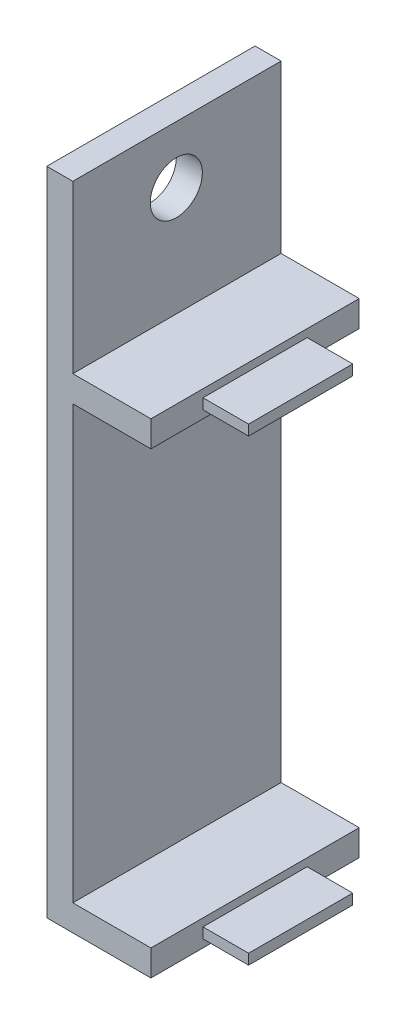
ISO-10303-21;
HEADER;
FILE_DESCRIPTION(('STEP AP214'),'2;1');
FILE_NAME('part.step','',(''),(''),'','','');
FILE_SCHEMA(('AUTOMOTIVE_DESIGN { 1 0 10303 214 1 1 1 1 }'));
ENDSEC;
DATA;
#1=APPLICATION_CONTEXT('core data for automotive mechanical design processes');
#2=APPLICATION_PROTOCOL_DEFINITION('international standard','automotive_design',2000,#1);
#3=PRODUCT_CONTEXT('',#1,'mechanical');
#4=PRODUCT('Part','Part','',(#3));
#5=PRODUCT_RELATED_PRODUCT_CATEGORY('part','',(#4));
#6=PRODUCT_DEFINITION_FORMATION('','',#4);
#7=PRODUCT_DEFINITION_CONTEXT('part definition',#1,'design');
#8=PRODUCT_DEFINITION('design','',#6,#7);
#9=PRODUCT_DEFINITION_SHAPE('','',#8);
#10=(LENGTH_UNIT() NAMED_UNIT(*) SI_UNIT(.MILLI.,.METRE.));
#11=(NAMED_UNIT(*) PLANE_ANGLE_UNIT() SI_UNIT($,.RADIAN.));
#12=(NAMED_UNIT(*) SI_UNIT($,.STERADIAN.) SOLID_ANGLE_UNIT());
#13=UNCERTAINTY_MEASURE_WITH_UNIT(LENGTH_MEASURE(1.E-05),#10,'distance_accuracy_value','');
#14=(GEOMETRIC_REPRESENTATION_CONTEXT(3) GLOBAL_UNCERTAINTY_ASSIGNED_CONTEXT((#13)) GLOBAL_UNIT_ASSIGNED_CONTEXT((#10,
#11,#12)) REPRESENTATION_CONTEXT('',''));
#15=CARTESIAN_POINT('',(0.,0.,0.));
#16=DIRECTION('',(0.,0.,1.));
#17=DIRECTION('',(1.,0.,0.));
#18=AXIS2_PLACEMENT_3D('',#15,#16,#17);
#19=CARTESIAN_POINT('',(-18.6732333333333,-18.84045,10.16));
#20=DIRECTION('',(-1.,0.,0.));
#21=DIRECTION('',(0.,0.,1.));
#22=AXIS2_PLACEMENT_3D('',#19,#20,#21);
#23=PLANE('',#22);
#24=DIRECTION('',(0.,1.,0.));
#25=VECTOR('',#24,1.);
#26=CARTESIAN_POINT('',(-18.6732333333333,-18.84045,0.));
#27=LINE('',#26,#25);
#28=CARTESIAN_POINT('',(-18.6732333333333,-20.11045,0.));
#29=VERTEX_POINT('',#28);
#30=CARTESIAN_POINT('',(-18.6732333333333,-18.84045,0.));
#31=VERTEX_POINT('',#30);
#32=EDGE_CURVE('E307',#29,#31,#27,.T.);
#33=ORIENTED_EDGE('',*,*,#32,.T.);
#34=DIRECTION('',(0.,0.,-1.));
#35=VECTOR('',#34,1.);
#36=CARTESIAN_POINT('',(-18.6732333333333,-18.84045,10.16));
#37=LINE('',#36,#35);
#38=CARTESIAN_POINT('',(-18.6732333333333,-18.84045,10.16));
#39=VERTEX_POINT('',#38);
#40=EDGE_CURVE('E323',#39,#31,#37,.T.);
#41=ORIENTED_EDGE('',*,*,#40,.F.);
#42=DIRECTION('',(0.,1.,0.));
#43=VECTOR('',#42,1.);
#44=CARTESIAN_POINT('',(-18.6732333333333,-18.84045,10.16));
#45=LINE('',#44,#43);
#46=CARTESIAN_POINT('',(-18.6732333333333,-20.11045,10.16));
#47=VERTEX_POINT('',#46);
#48=EDGE_CURVE('E286',#47,#39,#45,.T.);
#49=ORIENTED_EDGE('',*,*,#48,.F.);
#50=DIRECTION('',(0.,0.,-1.));
#51=VECTOR('',#50,1.);
#52=CARTESIAN_POINT('',(-18.6732333333333,-20.11045,10.16));
#53=LINE('',#52,#51);
#54=EDGE_CURVE('E327',#47,#29,#53,.T.);
#55=ORIENTED_EDGE('',*,*,#54,.T.);
#56=EDGE_LOOP('',(#33,#41,#49,#55));
#57=FACE_BOUND('',#56,.T.);
#58=DIRECTION('',(0.,0.,1.));
#59=VECTOR('',#58,1.);
#60=CARTESIAN_POINT('',(-18.6732333333333,-19.22145,2.54));
#61=LINE('',#60,#59);
#62=CARTESIAN_POINT('',(-18.6732333333333,-19.22145,2.54));
#63=VERTEX_POINT('',#62);
#64=CARTESIAN_POINT('',(-18.6732333333333,-19.22145,7.62));
#65=VERTEX_POINT('',#64);
#66=EDGE_CURVE('E188',#63,#65,#61,.T.);
#67=ORIENTED_EDGE('',*,*,#66,.F.);
#68=DIRECTION('',(0.,1.,0.));
#69=VECTOR('',#68,1.);
#70=CARTESIAN_POINT('',(-18.6732333333333,-19.72945,2.54));
#71=LINE('',#70,#69);
#72=CARTESIAN_POINT('',(-18.6732333333333,-19.72945,2.54));
#73=VERTEX_POINT('',#72);
#74=EDGE_CURVE('E185',#73,#63,#71,.T.);
#75=ORIENTED_EDGE('',*,*,#74,.F.);
#76=DIRECTION('',(0.,0.,-1.));
#77=VECTOR('',#76,1.);
#78=CARTESIAN_POINT('',(-18.6732333333333,-19.72945,7.62));
#79=LINE('',#78,#77);
#80=CARTESIAN_POINT('',(-18.6732333333333,-19.72945,7.62));
#81=VERTEX_POINT('',#80);
#82=EDGE_CURVE('E61',#81,#73,#79,.T.);
#83=ORIENTED_EDGE('',*,*,#82,.F.);
#84=DIRECTION('',(0.,-1.,0.));
#85=VECTOR('',#84,1.);
#86=CARTESIAN_POINT('',(-18.6732333333333,-19.22145,7.62));
#87=LINE('',#86,#85);
#88=EDGE_CURVE('E56',#65,#81,#87,.T.);
#89=ORIENTED_EDGE('',*,*,#88,.F.);
#90=EDGE_LOOP('',(#67,#75,#83,#89));
#91=FACE_BOUND('',#90,.T.);
#92=ADVANCED_FACE('F39',(#57,#91),#23,.F.);
#93=CARTESIAN_POINT('',(-18.6732333333333,0.,0.));
#94=DIRECTION('',(1.,0.,0.));
#95=DIRECTION('',(0.,0.,-1.));
#96=AXIS2_PLACEMENT_3D('',#93,#94,#95);
#97=PLANE('',#96);
#98=DIRECTION('',(0.,-1.,0.));
#99=VECTOR('',#98,1.);
#100=CARTESIAN_POINT('',(-18.6732333333333,3.51155,10.16));
#101=LINE('',#100,#99);
#102=CARTESIAN_POINT('',(-18.6732333333333,3.51155,10.16));
#103=VERTEX_POINT('',#102);
#104=CARTESIAN_POINT('',(-18.6732333333333,2.24155,10.16));
#105=VERTEX_POINT('',#104);
#106=EDGE_CURVE('E238',#103,#105,#101,.T.);
#107=ORIENTED_EDGE('',*,*,#106,.T.);
#108=DIRECTION('',(0.,0.,-1.));
#109=VECTOR('',#108,1.);
#110=CARTESIAN_POINT('',(-18.6732333333333,2.24155,10.16));
#111=LINE('',#110,#109);
#112=CARTESIAN_POINT('',(-18.6732333333333,2.24155,0.));
#113=VERTEX_POINT('',#112);
#114=EDGE_CURVE('E242',#105,#113,#111,.T.);
#115=ORIENTED_EDGE('',*,*,#114,.T.);
#116=DIRECTION('',(0.,1.,0.));
#117=VECTOR('',#116,1.);
#118=CARTESIAN_POINT('',(-18.6732333333333,2.24155,0.));
#119=LINE('',#118,#117);
#120=CARTESIAN_POINT('',(-18.6732333333333,3.51155,0.));
#121=VERTEX_POINT('',#120);
#122=EDGE_CURVE('E246',#113,#121,#119,.T.);
#123=ORIENTED_EDGE('',*,*,#122,.T.);
#124=DIRECTION('',(0.,0.,1.));
#125=VECTOR('',#124,1.);
#126=CARTESIAN_POINT('',(-18.6732333333333,3.51155,0.));
#127=LINE('',#126,#125);
#128=EDGE_CURVE('E249',#121,#103,#127,.T.);
#129=ORIENTED_EDGE('',*,*,#128,.T.);
#130=EDGE_LOOP('',(#107,#115,#123,#129));
#131=FACE_BOUND('',#130,.T.);
#132=DIRECTION('',(0.,-1.,0.));
#133=VECTOR('',#132,1.);
#134=CARTESIAN_POINT('',(-18.6732333333333,3.13055,7.62));
#135=LINE('',#134,#133);
#136=CARTESIAN_POINT('',(-18.6732333333333,3.13055,7.62));
#137=VERTEX_POINT('',#136);
#138=CARTESIAN_POINT('',(-18.6732333333333,2.62255,7.62));
#139=VERTEX_POINT('',#138);
#140=EDGE_CURVE('E195',#137,#139,#135,.T.);
#141=ORIENTED_EDGE('',*,*,#140,.F.);
#142=DIRECTION('',(0.,0.,1.));
#143=VECTOR('',#142,1.);
#144=CARTESIAN_POINT('',(-18.6732333333333,3.13055,2.54));
#145=LINE('',#144,#143);
#146=CARTESIAN_POINT('',(-18.6732333333333,3.13055,2.54));
#147=VERTEX_POINT('',#146);
#148=EDGE_CURVE('E190',#147,#137,#145,.T.);
#149=ORIENTED_EDGE('',*,*,#148,.F.);
#150=DIRECTION('',(0.,1.,0.));
#151=VECTOR('',#150,1.);
#152=CARTESIAN_POINT('',(-18.6732333333333,2.62255,2.54));
#153=LINE('',#152,#151);
#154=CARTESIAN_POINT('',(-18.6732333333333,2.62255,2.54));
#155=VERTEX_POINT('',#154);
#156=EDGE_CURVE('E206',#155,#147,#153,.T.);
#157=ORIENTED_EDGE('',*,*,#156,.F.);
#158=DIRECTION('',(0.,0.,-1.));
#159=VECTOR('',#158,1.);
#160=CARTESIAN_POINT('',(-18.6732333333333,2.62255,7.62));
#161=LINE('',#160,#159);
#162=EDGE_CURVE('E218',#139,#155,#161,.T.);
#163=ORIENTED_EDGE('',*,*,#162,.F.);
#164=EDGE_LOOP('',(#141,#149,#157,#163));
#165=FACE_BOUND('',#164,.T.);
#166=ADVANCED_FACE('F374',(#131,#165),#97,.T.);
#167=CARTESIAN_POINT('',(-22.4832333333333,11.63955,10.16));
#168=DIRECTION('',(-1.,0.,0.));
#169=DIRECTION('',(0.,-1.,0.));
#170=AXIS2_PLACEMENT_3D('',#167,#168,#169);
#171=PLANE('',#170);
#172=DIRECTION('',(0.,0.,-1.));
#173=VECTOR('',#172,1.);
#174=CARTESIAN_POINT('',(-22.4832333333333,2.24155,10.16));
#175=LINE('',#174,#173);
#176=CARTESIAN_POINT('',(-22.4832333333333,2.24155000000001,10.16));
#177=VERTEX_POINT('',#176);
#178=CARTESIAN_POINT('',(-22.4832333333333,2.24155000000001,0.));
#179=VERTEX_POINT('',#178);
#180=EDGE_CURVE('E237',#177,#179,#175,.T.);
#181=ORIENTED_EDGE('',*,*,#180,.F.);
#182=DIRECTION('',(0.,1.,0.));
#183=VECTOR('',#182,1.);
#184=CARTESIAN_POINT('',(-22.4832333333333,11.63955,10.16));
#185=LINE('',#184,#183);
#186=CARTESIAN_POINT('',(-22.4832333333333,-18.84045,10.16));
#187=VERTEX_POINT('',#186);
#188=EDGE_CURVE('E293',#187,#177,#185,.T.);
#189=ORIENTED_EDGE('',*,*,#188,.F.);
#190=DIRECTION('',(0.,0.,-1.));
#191=VECTOR('',#190,1.);
#192=CARTESIAN_POINT('',(-22.4832333333333,-18.84045,10.16));
#193=LINE('',#192,#191);
#194=CARTESIAN_POINT('',(-22.4832333333333,-18.84045,0.));
#195=VERTEX_POINT('',#194);
#196=EDGE_CURVE('E319',#187,#195,#193,.T.);
#197=ORIENTED_EDGE('',*,*,#196,.T.);
#198=DIRECTION('',(0.,1.,0.));
#199=VECTOR('',#198,1.);
#200=CARTESIAN_POINT('',(-22.4832333333333,11.63955,0.));
#201=LINE('',#200,#199);
#202=EDGE_CURVE('E280',#195,#179,#201,.T.);
#203=ORIENTED_EDGE('',*,*,#202,.T.);
#204=EDGE_LOOP('',(#181,#189,#197,#203));
#205=FACE_BOUND('',#204,.T.);
#206=ADVANCED_FACE('F380',(#205),#171,.F.);
#207=CARTESIAN_POINT('',(-22.4832333333333,8.84555,5.11168207856704));
#208=DIRECTION('',(1.,0.,0.));
#209=DIRECTION('',(0.,1.,0.));
#210=AXIS2_PLACEMENT_3D('',#207,#208,#209);
#211=CIRCLE('',#210,1.27);
#212=CARTESIAN_POINT('',(-22.4832333333333,10.11555,5.11168207856704));
#213=VERTEX_POINT('',#212);
#214=EDGE_CURVE('E406',#213,#213,#211,.T.);
#215=ORIENTED_EDGE('',*,*,#214,.F.);
#216=EDGE_LOOP('',(#215));
#217=FACE_BOUND('',#216,.T.);
#218=DIRECTION('',(0.,0.,1.));
#219=VECTOR('',#218,1.);
#220=CARTESIAN_POINT('',(-22.4832333333333,3.51155,0.));
#221=LINE('',#220,#219);
#222=CARTESIAN_POINT('',(-22.4832333333333,3.51155,0.));
#223=VERTEX_POINT('',#222);
#224=CARTESIAN_POINT('',(-22.4832333333333,3.51155000000001,10.16));
#225=VERTEX_POINT('',#224);
#226=EDGE_CURVE('E243',#223,#225,#221,.T.);
#227=ORIENTED_EDGE('',*,*,#226,.F.);
#228=CARTESIAN_POINT('',(-22.4832333333333,11.63955,0.));
#229=VERTEX_POINT('',#228);
#230=EDGE_CURVE('E313',#223,#229,#201,.T.);
#231=ORIENTED_EDGE('',*,*,#230,.T.);
#232=DIRECTION('',(0.,0.,-1.));
#233=VECTOR('',#232,1.);
#234=CARTESIAN_POINT('',(-22.4832333333333,11.63955,10.16));
#235=LINE('',#234,#233);
#236=CARTESIAN_POINT('',(-22.4832333333333,11.63955,10.16));
#237=VERTEX_POINT('',#236);
#238=EDGE_CURVE('E297',#237,#229,#235,.T.);
#239=ORIENTED_EDGE('',*,*,#238,.F.);
#240=EDGE_CURVE('E292',#225,#237,#185,.T.);
#241=ORIENTED_EDGE('',*,*,#240,.F.);
#242=EDGE_LOOP('',(#227,#231,#239,#241));
#243=FACE_BOUND('',#242,.T.);
#244=ADVANCED_FACE('F368',(#217,#243),#171,.F.);
#245=CARTESIAN_POINT('',(-23.7532333333333,11.63955,10.16));
#246=DIRECTION('',(0.,-1.,0.));
#247=DIRECTION('',(0.,0.,-1.));
#248=AXIS2_PLACEMENT_3D('',#245,#246,#247);
#249=PLANE('',#248);
#250=DIRECTION('',(-1.,0.,0.));
#251=VECTOR('',#250,1.);
#252=CARTESIAN_POINT('',(-23.7532333333333,11.63955,0.));
#253=LINE('',#252,#251);
#254=CARTESIAN_POINT('',(-23.7532333333333,11.63955,0.));
#255=VERTEX_POINT('',#254);
#256=EDGE_CURVE('E274',#229,#255,#253,.T.);
#257=ORIENTED_EDGE('',*,*,#256,.T.);
#258=DIRECTION('',(0.,0.,-1.));
#259=VECTOR('',#258,1.);
#260=CARTESIAN_POINT('',(-23.7532333333333,11.63955,10.16));
#261=LINE('',#260,#259);
#262=CARTESIAN_POINT('',(-23.7532333333333,11.63955,10.16));
#263=VERTEX_POINT('',#262);
#264=EDGE_CURVE('E11',#263,#255,#261,.T.);
#265=ORIENTED_EDGE('',*,*,#264,.F.);
#266=DIRECTION('',(-1.,0.,0.));
#267=VECTOR('',#266,1.);
#268=CARTESIAN_POINT('',(-23.7532333333333,11.63955,10.16));
#269=LINE('',#268,#267);
#270=EDGE_CURVE('E275',#237,#263,#269,.T.);
#271=ORIENTED_EDGE('',*,*,#270,.F.);
#272=ORIENTED_EDGE('',*,*,#238,.T.);
#273=EDGE_LOOP('',(#257,#265,#271,#272));
#274=FACE_BOUND('',#273,.T.);
#275=ADVANCED_FACE('F41',(#274),#249,.F.);
#276=CARTESIAN_POINT('',(-23.7532333333333,-20.11045,10.16));
#277=DIRECTION('',(1.,0.,0.));
#278=DIRECTION('',(0.,0.,-1.));
#279=AXIS2_PLACEMENT_3D('',#276,#277,#278);
#280=PLANE('',#279);
#281=CARTESIAN_POINT('',(-23.7532333333333,8.84555,5.11168207856704));
#282=DIRECTION('',(1.,0.,0.));
#283=DIRECTION('',(0.,0.,-1.));
#284=AXIS2_PLACEMENT_3D('',#281,#282,#283);
#285=CIRCLE('',#284,1.27);
#286=CARTESIAN_POINT('',(-23.7532333333333,8.84555,3.84168207856704));
#287=VERTEX_POINT('',#286);
#288=EDGE_CURVE('E43',#287,#287,#285,.T.);
#289=ORIENTED_EDGE('',*,*,#288,.T.);
#290=EDGE_LOOP('',(#289));
#291=FACE_BOUND('',#290,.T.);
#292=DIRECTION('',(0.,-1.,0.));
#293=VECTOR('',#292,1.);
#294=CARTESIAN_POINT('',(-23.7532333333333,-20.11045,0.));
#295=LINE('',#294,#293);
#296=CARTESIAN_POINT('',(-23.7532333333333,-20.11045,0.));
#297=VERTEX_POINT('',#296);
#298=EDGE_CURVE('E301',#255,#297,#295,.T.);
#299=ORIENTED_EDGE('',*,*,#298,.T.);
#300=DIRECTION('',(0.,0.,-1.));
#301=VECTOR('',#300,1.);
#302=CARTESIAN_POINT('',(-23.7532333333333,-20.11045,10.16));
#303=LINE('',#302,#301);
#304=CARTESIAN_POINT('',(-23.7532333333333,-20.11045,10.16));
#305=VERTEX_POINT('',#304);
#306=EDGE_CURVE('E49',#305,#297,#303,.T.);
#307=ORIENTED_EDGE('',*,*,#306,.F.);
#308=DIRECTION('',(0.,-1.,0.));
#309=VECTOR('',#308,1.);
#310=CARTESIAN_POINT('',(-23.7532333333333,-20.11045,10.16));
#311=LINE('',#310,#309);
#312=EDGE_CURVE('E279',#263,#305,#311,.T.);
#313=ORIENTED_EDGE('',*,*,#312,.F.);
#314=ORIENTED_EDGE('',*,*,#264,.T.);
#315=EDGE_LOOP('',(#299,#307,#313,#314));
#316=FACE_BOUND('',#315,.T.);
#317=ADVANCED_FACE('F359',(#291,#316),#280,.F.);
#318=CARTESIAN_POINT('',(-18.6732333333333,-20.11045,10.16));
#319=DIRECTION('',(0.,1.,0.));
#320=DIRECTION('',(0.,0.,1.));
#321=AXIS2_PLACEMENT_3D('',#318,#319,#320);
#322=PLANE('',#321);
#323=DIRECTION('',(1.,0.,0.));
#324=VECTOR('',#323,1.);
#325=CARTESIAN_POINT('',(-18.6732333333333,-20.11045,0.));
#326=LINE('',#325,#324);
#327=EDGE_CURVE('E304',#297,#29,#326,.T.);
#328=ORIENTED_EDGE('',*,*,#327,.T.);
#329=ORIENTED_EDGE('',*,*,#54,.F.);
#330=DIRECTION('',(1.,0.,0.));
#331=VECTOR('',#330,1.);
#332=CARTESIAN_POINT('',(-18.6732333333333,-20.11045,10.16));
#333=LINE('',#332,#331);
#334=EDGE_CURVE('E283',#305,#47,#333,.T.);
#335=ORIENTED_EDGE('',*,*,#334,.F.);
#336=ORIENTED_EDGE('',*,*,#306,.T.);
#337=EDGE_LOOP('',(#328,#329,#335,#336));
#338=FACE_BOUND('',#337,.T.);
#339=ADVANCED_FACE('F337',(#338),#322,.F.);
#340=CARTESIAN_POINT('',(-22.4832333333333,-18.84045,10.16));
#341=DIRECTION('',(0.,-1.,0.));
#342=DIRECTION('',(0.,0.,-1.));
#343=AXIS2_PLACEMENT_3D('',#340,#341,#342);
#344=PLANE('',#343);
#345=DIRECTION('',(-1.,0.,0.));
#346=VECTOR('',#345,1.);
#347=CARTESIAN_POINT('',(-22.4832333333333,-18.84045,0.));
#348=LINE('',#347,#346);
#349=EDGE_CURVE('E310',#31,#195,#348,.T.);
#350=ORIENTED_EDGE('',*,*,#349,.T.);
#351=ORIENTED_EDGE('',*,*,#196,.F.);
#352=DIRECTION('',(-1.,0.,0.));
#353=VECTOR('',#352,1.);
#354=CARTESIAN_POINT('',(-22.4832333333333,-18.84045,10.16));
#355=LINE('',#354,#353);
#356=EDGE_CURVE('E289',#39,#187,#355,.T.);
#357=ORIENTED_EDGE('',*,*,#356,.F.);
#358=ORIENTED_EDGE('',*,*,#40,.T.);
#359=EDGE_LOOP('',(#350,#351,#357,#358));
#360=FACE_BOUND('',#359,.T.);
#361=ADVANCED_FACE('F351',(#360),#344,.F.);
#362=CARTESIAN_POINT('',(0.,0.,10.16));
#363=DIRECTION('',(0.,0.,-1.));
#364=DIRECTION('',(-1.,0.,0.));
#365=AXIS2_PLACEMENT_3D('',#362,#363,#364);
#366=PLANE('',#365);
#367=ORIENTED_EDGE('',*,*,#270,.T.);
#368=ORIENTED_EDGE('',*,*,#312,.T.);
#369=ORIENTED_EDGE('',*,*,#334,.T.);
#370=ORIENTED_EDGE('',*,*,#48,.T.);
#371=ORIENTED_EDGE('',*,*,#356,.T.);
#372=ORIENTED_EDGE('',*,*,#188,.T.);
#373=DIRECTION('',(-1.,0.,0.));
#374=VECTOR('',#373,1.);
#375=CARTESIAN_POINT('',(-18.6732333333333,2.24155,10.16));
#376=LINE('',#375,#374);
#377=EDGE_CURVE('E270',#105,#177,#376,.T.);
#378=ORIENTED_EDGE('',*,*,#377,.F.);
#379=ORIENTED_EDGE('',*,*,#106,.F.);
#380=DIRECTION('',(-1.,0.,0.));
#381=VECTOR('',#380,1.);
#382=CARTESIAN_POINT('',(-18.6732333333333,3.51155,10.16));
#383=LINE('',#382,#381);
#384=EDGE_CURVE('E252',#103,#225,#383,.T.);
#385=ORIENTED_EDGE('',*,*,#384,.T.);
#386=ORIENTED_EDGE('',*,*,#240,.T.);
#387=EDGE_LOOP('',(#367,#368,#369,#370,#371,#372,#378,#379,#385,#386));
#388=FACE_BOUND('',#387,.T.);
#389=ADVANCED_FACE('F355',(#388),#366,.F.);
#390=CARTESIAN_POINT('',(0.,0.,0.));
#391=DIRECTION('',(0.,0.,-1.));
#392=DIRECTION('',(-1.,0.,0.));
#393=AXIS2_PLACEMENT_3D('',#390,#391,#392);
#394=PLANE('',#393);
#395=ORIENTED_EDGE('',*,*,#256,.F.);
#396=ORIENTED_EDGE('',*,*,#230,.F.);
#397=DIRECTION('',(-1.,0.,0.));
#398=VECTOR('',#397,1.);
#399=CARTESIAN_POINT('',(-18.6732333333333,3.51155,0.));
#400=LINE('',#399,#398);
#401=EDGE_CURVE('E262',#121,#223,#400,.T.);
#402=ORIENTED_EDGE('',*,*,#401,.F.);
#403=ORIENTED_EDGE('',*,*,#122,.F.);
#404=DIRECTION('',(-1.,0.,0.));
#405=VECTOR('',#404,1.);
#406=CARTESIAN_POINT('',(-18.6732333333333,2.24155,0.));
#407=LINE('',#406,#405);
#408=EDGE_CURVE('E266',#113,#179,#407,.T.);
#409=ORIENTED_EDGE('',*,*,#408,.T.);
#410=ORIENTED_EDGE('',*,*,#202,.F.);
#411=ORIENTED_EDGE('',*,*,#349,.F.);
#412=ORIENTED_EDGE('',*,*,#32,.F.);
#413=ORIENTED_EDGE('',*,*,#327,.F.);
#414=ORIENTED_EDGE('',*,*,#298,.F.);
#415=EDGE_LOOP('',(#395,#396,#402,#403,#409,#410,#411,#412,#413,#414));
#416=FACE_BOUND('',#415,.T.);
#417=ADVANCED_FACE('F343',(#416),#394,.T.);
#418=CARTESIAN_POINT('',(-18.6732333333333,2.24155,10.16));
#419=DIRECTION('',(0.,1.,0.));
#420=DIRECTION('',(-1.,0.,0.));
#421=AXIS2_PLACEMENT_3D('',#418,#419,#420);
#422=PLANE('',#421);
#423=ORIENTED_EDGE('',*,*,#180,.T.);
#424=ORIENTED_EDGE('',*,*,#408,.F.);
#425=ORIENTED_EDGE('',*,*,#114,.F.);
#426=ORIENTED_EDGE('',*,*,#377,.T.);
#427=EDGE_LOOP('',(#423,#424,#425,#426));
#428=FACE_BOUND('',#427,.T.);
#429=ADVANCED_FACE('F378',(#428),#422,.F.);
#430=CARTESIAN_POINT('',(-18.6732333333333,3.51155,0.));
#431=DIRECTION('',(0.,-1.,0.));
#432=DIRECTION('',(0.,0.,-1.));
#433=AXIS2_PLACEMENT_3D('',#430,#431,#432);
#434=PLANE('',#433);
#435=ORIENTED_EDGE('',*,*,#226,.T.);
#436=ORIENTED_EDGE('',*,*,#384,.F.);
#437=ORIENTED_EDGE('',*,*,#128,.F.);
#438=ORIENTED_EDGE('',*,*,#401,.T.);
#439=EDGE_LOOP('',(#435,#436,#437,#438));
#440=FACE_BOUND('',#439,.T.);
#441=ADVANCED_FACE('F371',(#440),#434,.F.);
#442=CARTESIAN_POINT('',(-16.4507333333333,3.13055,2.54));
#443=DIRECTION('',(0.,-1.,0.));
#444=DIRECTION('',(0.,0.,-1.));
#445=AXIS2_PLACEMENT_3D('',#442,#443,#444);
#446=PLANE('',#445);
#447=ORIENTED_EDGE('',*,*,#148,.T.);
#448=DIRECTION('',(-1.,0.,0.));
#449=VECTOR('',#448,1.);
#450=CARTESIAN_POINT('',(-16.4507333333333,3.13055,7.62));
#451=LINE('',#450,#449);
#452=CARTESIAN_POINT('',(-16.4507333333333,3.13055,7.62));
#453=VERTEX_POINT('',#452);
#454=EDGE_CURVE('E234',#453,#137,#451,.T.);
#455=ORIENTED_EDGE('',*,*,#454,.F.);
#456=DIRECTION('',(0.,0.,1.));
#457=VECTOR('',#456,1.);
#458=CARTESIAN_POINT('',(-16.4507333333333,3.13055,2.54));
#459=LINE('',#458,#457);
#460=CARTESIAN_POINT('',(-16.4507333333333,3.13055,2.54));
#461=VERTEX_POINT('',#460);
#462=EDGE_CURVE('E201',#461,#453,#459,.T.);
#463=ORIENTED_EDGE('',*,*,#462,.F.);
#464=DIRECTION('',(-1.,0.,0.));
#465=VECTOR('',#464,1.);
#466=CARTESIAN_POINT('',(-16.4507333333333,3.13055,2.54));
#467=LINE('',#466,#465);
#468=EDGE_CURVE('E214',#461,#147,#467,.T.);
#469=ORIENTED_EDGE('',*,*,#468,.T.);
#470=EDGE_LOOP('',(#447,#455,#463,#469));
#471=FACE_BOUND('',#470,.T.);
#472=ADVANCED_FACE('F462',(#471),#446,.F.);
#473=CARTESIAN_POINT('',(-16.4507333333333,3.13055,7.62));
#474=DIRECTION('',(0.,0.,-1.));
#475=DIRECTION('',(-1.,0.,0.));
#476=AXIS2_PLACEMENT_3D('',#473,#474,#475);
#477=PLANE('',#476);
#478=ORIENTED_EDGE('',*,*,#140,.T.);
#479=DIRECTION('',(-1.,0.,0.));
#480=VECTOR('',#479,1.);
#481=CARTESIAN_POINT('',(-16.4507333333333,2.62255,7.62));
#482=LINE('',#481,#480);
#483=CARTESIAN_POINT('',(-16.4507333333333,2.62255,7.62));
#484=VERTEX_POINT('',#483);
#485=EDGE_CURVE('E230',#484,#139,#482,.T.);
#486=ORIENTED_EDGE('',*,*,#485,.F.);
#487=DIRECTION('',(0.,-1.,0.));
#488=VECTOR('',#487,1.);
#489=CARTESIAN_POINT('',(-16.4507333333333,3.13055,7.62));
#490=LINE('',#489,#488);
#491=EDGE_CURVE('E205',#453,#484,#490,.T.);
#492=ORIENTED_EDGE('',*,*,#491,.F.);
#493=ORIENTED_EDGE('',*,*,#454,.T.);
#494=EDGE_LOOP('',(#478,#486,#492,#493));
#495=FACE_BOUND('',#494,.T.);
#496=ADVANCED_FACE('F458',(#495),#477,.F.);
#497=CARTESIAN_POINT('',(-16.4507333333333,2.62255,7.62));
#498=DIRECTION('',(0.,1.,0.));
#499=DIRECTION('',(0.,0.,1.));
#500=AXIS2_PLACEMENT_3D('',#497,#498,#499);
#501=PLANE('',#500);
#502=ORIENTED_EDGE('',*,*,#162,.T.);
#503=DIRECTION('',(-1.,0.,0.));
#504=VECTOR('',#503,1.);
#505=CARTESIAN_POINT('',(-16.4507333333333,2.62255,2.54));
#506=LINE('',#505,#504);
#507=CARTESIAN_POINT('',(-16.4507333333333,2.62255,2.54));
#508=VERTEX_POINT('',#507);
#509=EDGE_CURVE('E227',#508,#155,#506,.T.);
#510=ORIENTED_EDGE('',*,*,#509,.F.);
#511=DIRECTION('',(0.,0.,-1.));
#512=VECTOR('',#511,1.);
#513=CARTESIAN_POINT('',(-16.4507333333333,2.62255,7.62));
#514=LINE('',#513,#512);
#515=EDGE_CURVE('E209',#484,#508,#514,.T.);
#516=ORIENTED_EDGE('',*,*,#515,.F.);
#517=ORIENTED_EDGE('',*,*,#485,.T.);
#518=EDGE_LOOP('',(#502,#510,#516,#517));
#519=FACE_BOUND('',#518,.T.);
#520=ADVANCED_FACE('F454',(#519),#501,.F.);
#521=CARTESIAN_POINT('',(-16.4507333333333,2.62255,2.54));
#522=DIRECTION('',(0.,0.,1.));
#523=DIRECTION('',(1.,0.,0.));
#524=AXIS2_PLACEMENT_3D('',#521,#522,#523);
#525=PLANE('',#524);
#526=ORIENTED_EDGE('',*,*,#156,.T.);
#527=ORIENTED_EDGE('',*,*,#468,.F.);
#528=DIRECTION('',(0.,1.,0.));
#529=VECTOR('',#528,1.);
#530=CARTESIAN_POINT('',(-16.4507333333333,2.62255,2.54));
#531=LINE('',#530,#529);
#532=EDGE_CURVE('E212',#508,#461,#531,.T.);
#533=ORIENTED_EDGE('',*,*,#532,.F.);
#534=ORIENTED_EDGE('',*,*,#509,.T.);
#535=EDGE_LOOP('',(#526,#527,#533,#534));
#536=FACE_BOUND('',#535,.T.);
#537=ADVANCED_FACE('F450',(#536),#525,.F.);
#538=CARTESIAN_POINT('',(-16.4507333333333,0.,0.));
#539=DIRECTION('',(1.,0.,0.));
#540=DIRECTION('',(0.,0.,-1.));
#541=AXIS2_PLACEMENT_3D('',#538,#539,#540);
#542=PLANE('',#541);
#543=ORIENTED_EDGE('',*,*,#462,.T.);
#544=ORIENTED_EDGE('',*,*,#491,.T.);
#545=ORIENTED_EDGE('',*,*,#515,.T.);
#546=ORIENTED_EDGE('',*,*,#532,.T.);
#547=EDGE_LOOP('',(#543,#544,#545,#546));
#548=FACE_BOUND('',#547,.T.);
#549=ADVANCED_FACE('F447',(#548),#542,.T.);
#550=CARTESIAN_POINT('',(-16.4507333333333,-19.22145,2.54));
#551=DIRECTION('',(0.,-1.,0.));
#552=DIRECTION('',(0.,0.,-1.));
#553=AXIS2_PLACEMENT_3D('',#550,#551,#552);
#554=PLANE('',#553);
#555=ORIENTED_EDGE('',*,*,#66,.T.);
#556=DIRECTION('',(-1.,0.,0.));
#557=VECTOR('',#556,1.);
#558=CARTESIAN_POINT('',(-16.4507333333333,-19.22145,7.62));
#559=LINE('',#558,#557);
#560=CARTESIAN_POINT('',(-16.4507333333333,-19.22145,7.62));
#561=VERTEX_POINT('',#560);
#562=EDGE_CURVE('E167',#561,#65,#559,.T.);
#563=ORIENTED_EDGE('',*,*,#562,.F.);
#564=DIRECTION('',(0.,0.,1.));
#565=VECTOR('',#564,1.);
#566=CARTESIAN_POINT('',(-16.4507333333333,-19.22145,2.54));
#567=LINE('',#566,#565);
#568=CARTESIAN_POINT('',(-16.4507333333333,-19.22145,2.54));
#569=VERTEX_POINT('',#568);
#570=EDGE_CURVE('E175',#569,#561,#567,.T.);
#571=ORIENTED_EDGE('',*,*,#570,.F.);
#572=DIRECTION('',(-1.,0.,0.));
#573=VECTOR('',#572,1.);
#574=CARTESIAN_POINT('',(-16.4507333333333,-19.22145,2.54));
#575=LINE('',#574,#573);
#576=EDGE_CURVE('E418',#569,#63,#575,.T.);
#577=ORIENTED_EDGE('',*,*,#576,.T.);
#578=EDGE_LOOP('',(#555,#563,#571,#577));
#579=FACE_BOUND('',#578,.T.);
#580=ADVANCED_FACE('F187',(#579),#554,.F.);
#581=CARTESIAN_POINT('',(-16.4507333333333,-19.22145,7.62));
#582=DIRECTION('',(0.,0.,-1.));
#583=DIRECTION('',(-1.,0.,0.));
#584=AXIS2_PLACEMENT_3D('',#581,#582,#583);
#585=PLANE('',#584);
#586=ORIENTED_EDGE('',*,*,#88,.T.);
#587=DIRECTION('',(-1.,0.,0.));
#588=VECTOR('',#587,1.);
#589=CARTESIAN_POINT('',(-16.4507333333333,-19.72945,7.62));
#590=LINE('',#589,#588);
#591=CARTESIAN_POINT('',(-16.4507333333333,-19.72945,7.62));
#592=VERTEX_POINT('',#591);
#593=EDGE_CURVE('E170',#592,#81,#590,.T.);
#594=ORIENTED_EDGE('',*,*,#593,.F.);
#595=DIRECTION('',(0.,-1.,0.));
#596=VECTOR('',#595,1.);
#597=CARTESIAN_POINT('',(-16.4507333333333,-19.22145,7.62));
#598=LINE('',#597,#596);
#599=EDGE_CURVE('E163',#561,#592,#598,.T.);
#600=ORIENTED_EDGE('',*,*,#599,.F.);
#601=ORIENTED_EDGE('',*,*,#562,.T.);
#602=EDGE_LOOP('',(#586,#594,#600,#601));
#603=FACE_BOUND('',#602,.T.);
#604=ADVANCED_FACE('F165',(#603),#585,.F.);
#605=CARTESIAN_POINT('',(-16.4507333333333,-19.72945,7.62));
#606=DIRECTION('',(0.,1.,0.));
#607=DIRECTION('',(0.,0.,1.));
#608=AXIS2_PLACEMENT_3D('',#605,#606,#607);
#609=PLANE('',#608);
#610=ORIENTED_EDGE('',*,*,#82,.T.);
#611=DIRECTION('',(-1.,0.,0.));
#612=VECTOR('',#611,1.);
#613=CARTESIAN_POINT('',(-16.4507333333333,-19.72945,2.54));
#614=LINE('',#613,#612);
#615=CARTESIAN_POINT('',(-16.4507333333333,-19.72945,2.54));
#616=VERTEX_POINT('',#615);
#617=EDGE_CURVE('E197',#616,#73,#614,.T.);
#618=ORIENTED_EDGE('',*,*,#617,.F.);
#619=DIRECTION('',(0.,0.,-1.));
#620=VECTOR('',#619,1.);
#621=CARTESIAN_POINT('',(-16.4507333333333,-19.72945,7.62));
#622=LINE('',#621,#620);
#623=EDGE_CURVE('E174',#592,#616,#622,.T.);
#624=ORIENTED_EDGE('',*,*,#623,.F.);
#625=ORIENTED_EDGE('',*,*,#593,.T.);
#626=EDGE_LOOP('',(#610,#618,#624,#625));
#627=FACE_BOUND('',#626,.T.);
#628=ADVANCED_FACE('F434',(#627),#609,.F.);
#629=CARTESIAN_POINT('',(-16.4507333333333,-19.72945,2.54));
#630=DIRECTION('',(0.,0.,1.));
#631=DIRECTION('',(1.,0.,0.));
#632=AXIS2_PLACEMENT_3D('',#629,#630,#631);
#633=PLANE('',#632);
#634=ORIENTED_EDGE('',*,*,#74,.T.);
#635=ORIENTED_EDGE('',*,*,#576,.F.);
#636=DIRECTION('',(0.,1.,0.));
#637=VECTOR('',#636,1.);
#638=CARTESIAN_POINT('',(-16.4507333333333,-19.72945,2.54));
#639=LINE('',#638,#637);
#640=EDGE_CURVE('E180',#616,#569,#639,.T.);
#641=ORIENTED_EDGE('',*,*,#640,.F.);
#642=ORIENTED_EDGE('',*,*,#617,.T.);
#643=EDGE_LOOP('',(#634,#635,#641,#642));
#644=FACE_BOUND('',#643,.T.);
#645=ADVANCED_FACE('F432',(#644),#633,.F.);
#646=CARTESIAN_POINT('',(-16.4507333333333,0.,0.));
#647=DIRECTION('',(1.,0.,0.));
#648=DIRECTION('',(0.,0.,-1.));
#649=AXIS2_PLACEMENT_3D('',#646,#647,#648);
#650=PLANE('',#649);
#651=ORIENTED_EDGE('',*,*,#570,.T.);
#652=ORIENTED_EDGE('',*,*,#599,.T.);
#653=ORIENTED_EDGE('',*,*,#623,.T.);
#654=ORIENTED_EDGE('',*,*,#640,.T.);
#655=EDGE_LOOP('',(#651,#652,#653,#654));
#656=FACE_BOUND('',#655,.T.);
#657=ADVANCED_FACE('F178',(#656),#650,.T.);
#658=CARTESIAN_POINT('',(-24.7057333333333,8.84555,5.11168207856704));
#659=DIRECTION('',(1.,0.,0.));
#660=DIRECTION('',(0.,1.,0.));
#661=AXIS2_PLACEMENT_3D('',#658,#659,#660);
#662=CYLINDRICAL_SURFACE('',#661,1.27);
#663=ORIENTED_EDGE('',*,*,#214,.T.);
#664=EDGE_LOOP('',(#663));
#665=FACE_BOUND('',#664,.T.);
#666=ORIENTED_EDGE('',*,*,#288,.F.);
#667=EDGE_LOOP('',(#666));
#668=FACE_BOUND('',#667,.T.);
#669=ADVANCED_FACE('F534',(#665,#668),#662,.F.);
#670=CLOSED_SHELL('',(#92,#166,#206,#244,#275,#317,#339,#361,#389,#417,#429,#441,#472,#496,#520,
#537,#549,#580,#604,#628,#645,#657,#669));
#671=MANIFOLD_SOLID_BREP('B2',#670);
#672=ADVANCED_BREP_SHAPE_REPRESENTATION('',(#18,#671),#14);
#673=SHAPE_DEFINITION_REPRESENTATION(#9,#672);
ENDSEC;
END-ISO-10303-21;
